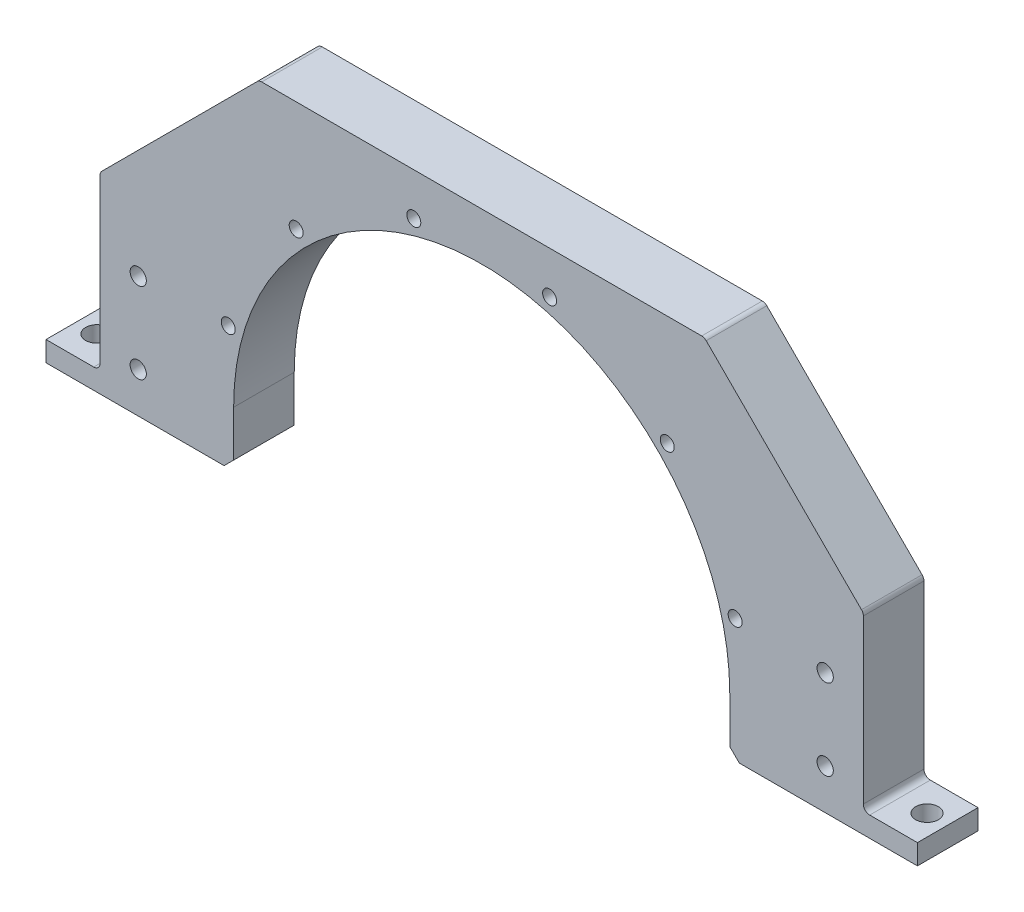
ISO-10303-21;
HEADER;
FILE_DESCRIPTION(('STEP AP214'),'2;1');
FILE_NAME('part.step','',(''),(''),'','','');
FILE_SCHEMA(('AUTOMOTIVE_DESIGN { 1 0 10303 214 1 1 1 1 }'));
ENDSEC;
DATA;
#1=APPLICATION_CONTEXT('core data for automotive mechanical design processes');
#2=APPLICATION_PROTOCOL_DEFINITION('international standard','automotive_design',2000,#1);
#3=PRODUCT_CONTEXT('',#1,'mechanical');
#4=PRODUCT('Part','Part','',(#3));
#5=PRODUCT_RELATED_PRODUCT_CATEGORY('part','',(#4));
#6=PRODUCT_DEFINITION_FORMATION('','',#4);
#7=PRODUCT_DEFINITION_CONTEXT('part definition',#1,'design');
#8=PRODUCT_DEFINITION('design','',#6,#7);
#9=PRODUCT_DEFINITION_SHAPE('','',#8);
#10=(LENGTH_UNIT() NAMED_UNIT(*) SI_UNIT(.MILLI.,.METRE.));
#11=(NAMED_UNIT(*) PLANE_ANGLE_UNIT() SI_UNIT($,.RADIAN.));
#12=(NAMED_UNIT(*) SI_UNIT($,.STERADIAN.) SOLID_ANGLE_UNIT());
#13=UNCERTAINTY_MEASURE_WITH_UNIT(LENGTH_MEASURE(1.E-05),#10,'distance_accuracy_value','');
#14=(GEOMETRIC_REPRESENTATION_CONTEXT(3) GLOBAL_UNCERTAINTY_ASSIGNED_CONTEXT((#13)) GLOBAL_UNIT_ASSIGNED_CONTEXT((#10,
#11,#12)) REPRESENTATION_CONTEXT('',''));
#15=CARTESIAN_POINT('',(0.,0.,0.));
#16=DIRECTION('',(0.,0.,1.));
#17=DIRECTION('',(1.,0.,0.));
#18=AXIS2_PLACEMENT_3D('',#15,#16,#17);
#19=CARTESIAN_POINT('',(0.,0.,19.05));
#20=DIRECTION('',(0.,0.,-1.));
#21=DIRECTION('',(-1.,0.,0.));
#22=AXIS2_PLACEMENT_3D('',#19,#20,#21);
#23=CYLINDRICAL_SURFACE('',#22,78.);
#24=CARTESIAN_POINT('',(0.,0.,0.));
#25=DIRECTION('',(0.,0.,-1.));
#26=DIRECTION('',(-1.,0.,0.));
#27=AXIS2_PLACEMENT_3D('',#24,#25,#26);
#28=CIRCLE('',#27,78.);
#29=CARTESIAN_POINT('',(-78.,0.,0.));
#30=VERTEX_POINT('',#29);
#31=CARTESIAN_POINT('',(78.,0.,0.));
#32=VERTEX_POINT('',#31);
#33=EDGE_CURVE('E304',#30,#32,#28,.T.);
#34=ORIENTED_EDGE('',*,*,#33,.T.);
#35=DIRECTION('',(0.,0.,-1.));
#36=VECTOR('',#35,1.);
#37=CARTESIAN_POINT('',(78.,0.,19.05));
#38=LINE('',#37,#36);
#39=CARTESIAN_POINT('',(78.,0.,19.05));
#40=VERTEX_POINT('',#39);
#41=EDGE_CURVE('E193',#40,#32,#38,.T.);
#42=ORIENTED_EDGE('',*,*,#41,.F.);
#43=CARTESIAN_POINT('',(0.,0.,19.05));
#44=DIRECTION('',(0.,0.,-1.));
#45=DIRECTION('',(-1.,0.,0.));
#46=AXIS2_PLACEMENT_3D('',#43,#44,#45);
#47=CIRCLE('',#46,78.);
#48=CARTESIAN_POINT('',(-78.,0.,19.05));
#49=VERTEX_POINT('',#48);
#50=EDGE_CURVE('E188',#49,#40,#47,.T.);
#51=ORIENTED_EDGE('',*,*,#50,.F.);
#52=DIRECTION('',(0.,0.,-1.));
#53=VECTOR('',#52,1.);
#54=CARTESIAN_POINT('',(-78.,0.,19.05));
#55=LINE('',#54,#53);
#56=EDGE_CURVE('E191',#49,#30,#55,.T.);
#57=ORIENTED_EDGE('',*,*,#56,.T.);
#58=EDGE_LOOP('',(#34,#42,#51,#57));
#59=FACE_BOUND('',#58,.T.);
#60=ADVANCED_FACE('F37',(#59),#23,.F.);
#61=CARTESIAN_POINT('',(78.,0.,19.05));
#62=DIRECTION('',(1.,0.,0.));
#63=DIRECTION('',(0.,0.,-1.));
#64=AXIS2_PLACEMENT_3D('',#61,#62,#63);
#65=PLANE('',#64);
#66=DIRECTION('',(0.,-1.,0.));
#67=VECTOR('',#66,1.);
#68=CARTESIAN_POINT('',(78.,0.,0.));
#69=LINE('',#68,#67);
#70=CARTESIAN_POINT('',(78.,-14.4,0.));
#71=VERTEX_POINT('',#70);
#72=EDGE_CURVE('E320',#32,#71,#69,.T.);
#73=ORIENTED_EDGE('',*,*,#72,.T.);
#74=DIRECTION('',(0.,0.,1.));
#75=VECTOR('',#74,1.);
#76=CARTESIAN_POINT('',(78.,-14.4,19.05));
#77=LINE('',#76,#75);
#78=CARTESIAN_POINT('',(78.,-14.4,19.05));
#79=VERTEX_POINT('',#78);
#80=EDGE_CURVE('E344',#71,#79,#77,.T.);
#81=ORIENTED_EDGE('',*,*,#80,.T.);
#82=DIRECTION('',(0.,-1.,0.));
#83=VECTOR('',#82,1.);
#84=CARTESIAN_POINT('',(78.,0.,19.05));
#85=LINE('',#84,#83);
#86=EDGE_CURVE('E197',#40,#79,#85,.T.);
#87=ORIENTED_EDGE('',*,*,#86,.F.);
#88=ORIENTED_EDGE('',*,*,#41,.T.);
#89=EDGE_LOOP('',(#73,#81,#87,#88));
#90=FACE_BOUND('',#89,.T.);
#91=ADVANCED_FACE('F512',(#90),#65,.F.);
#92=CARTESIAN_POINT('',(78.,-17.4,19.05));
#93=DIRECTION('',(0.,1.,0.));
#94=DIRECTION('',(0.,0.,1.));
#95=AXIS2_PLACEMENT_3D('',#92,#93,#94);
#96=PLANE('',#95);
#97=CARTESIAN_POINT('',(130.5,-17.4,9.525));
#98=DIRECTION('',(0.,1.,0.));
#99=DIRECTION('',(0.,0.,1.));
#100=AXIS2_PLACEMENT_3D('',#97,#98,#99);
#101=CIRCLE('',#100,3.57124);
#102=CARTESIAN_POINT('',(130.5,-17.4,13.09624));
#103=VERTEX_POINT('',#102);
#104=EDGE_CURVE('E272',#103,#103,#101,.T.);
#105=ORIENTED_EDGE('',*,*,#104,.T.);
#106=EDGE_LOOP('',(#105));
#107=FACE_BOUND('',#106,.T.);
#108=DIRECTION('',(1.,0.,0.));
#109=VECTOR('',#108,1.);
#110=CARTESIAN_POINT('',(78.,-17.4,19.05));
#111=LINE('',#110,#109);
#112=CARTESIAN_POINT('',(81.,-17.4,19.05));
#113=VERTEX_POINT('',#112);
#114=CARTESIAN_POINT('',(137.,-17.4,19.05));
#115=VERTEX_POINT('',#114);
#116=EDGE_CURVE('E307',#113,#115,#111,.T.);
#117=ORIENTED_EDGE('',*,*,#116,.F.);
#118=DIRECTION('',(0.,0.,-1.));
#119=VECTOR('',#118,1.);
#120=CARTESIAN_POINT('',(81.,-17.4,19.05));
#121=LINE('',#120,#119);
#122=CARTESIAN_POINT('',(81.,-17.4,0.));
#123=VERTEX_POINT('',#122);
#124=EDGE_CURVE('E339',#113,#123,#121,.T.);
#125=ORIENTED_EDGE('',*,*,#124,.T.);
#126=DIRECTION('',(1.,0.,0.));
#127=VECTOR('',#126,1.);
#128=CARTESIAN_POINT('',(78.,-17.4,0.));
#129=LINE('',#128,#127);
#130=CARTESIAN_POINT('',(137.,-17.4,0.));
#131=VERTEX_POINT('',#130);
#132=EDGE_CURVE('E323',#123,#131,#129,.T.);
#133=ORIENTED_EDGE('',*,*,#132,.T.);
#134=DIRECTION('',(0.,0.,-1.));
#135=VECTOR('',#134,1.);
#136=CARTESIAN_POINT('',(137.,-17.4,19.05));
#137=LINE('',#136,#135);
#138=EDGE_CURVE('E335',#115,#131,#137,.T.);
#139=ORIENTED_EDGE('',*,*,#138,.F.);
#140=EDGE_LOOP('',(#117,#125,#133,#139));
#141=FACE_BOUND('',#140,.T.);
#142=ADVANCED_FACE('F517',(#107,#141),#96,.F.);
#143=CARTESIAN_POINT('',(137.,-17.4,19.05));
#144=DIRECTION('',(-1.,0.,0.));
#145=DIRECTION('',(0.,0.,1.));
#146=AXIS2_PLACEMENT_3D('',#143,#144,#145);
#147=PLANE('',#146);
#148=DIRECTION('',(0.,1.,0.));
#149=VECTOR('',#148,1.);
#150=CARTESIAN_POINT('',(137.,-17.4,0.));
#151=LINE('',#150,#149);
#152=CARTESIAN_POINT('',(137.,-11.05,0.));
#153=VERTEX_POINT('',#152);
#154=EDGE_CURVE('E325',#131,#153,#151,.T.);
#155=ORIENTED_EDGE('',*,*,#154,.T.);
#156=DIRECTION('',(0.,0.,-1.));
#157=VECTOR('',#156,1.);
#158=CARTESIAN_POINT('',(137.,-11.05,19.05));
#159=LINE('',#158,#157);
#160=CARTESIAN_POINT('',(137.,-11.05,19.05));
#161=VERTEX_POINT('',#160);
#162=EDGE_CURVE('E318',#161,#153,#159,.T.);
#163=ORIENTED_EDGE('',*,*,#162,.F.);
#164=DIRECTION('',(0.,1.,0.));
#165=VECTOR('',#164,1.);
#166=CARTESIAN_POINT('',(137.,-17.4,19.05));
#167=LINE('',#166,#165);
#168=EDGE_CURVE('E309',#115,#161,#167,.T.);
#169=ORIENTED_EDGE('',*,*,#168,.F.);
#170=ORIENTED_EDGE('',*,*,#138,.T.);
#171=EDGE_LOOP('',(#155,#163,#169,#170));
#172=FACE_BOUND('',#171,.T.);
#173=ADVANCED_FACE('F717',(#172),#147,.F.);
#174=CARTESIAN_POINT('',(137.,-11.05,19.05));
#175=DIRECTION('',(0.,-1.,0.));
#176=DIRECTION('',(0.,0.,-1.));
#177=AXIS2_PLACEMENT_3D('',#174,#175,#176);
#178=PLANE('',#177);
#179=CARTESIAN_POINT('',(130.5,-11.05,9.525));
#180=DIRECTION('',(0.,1.,0.));
#181=DIRECTION('',(0.,0.,1.));
#182=AXIS2_PLACEMENT_3D('',#179,#180,#181);
#183=CIRCLE('',#182,3.57124);
#184=CARTESIAN_POINT('',(130.5,-11.05,13.09624));
#185=VERTEX_POINT('',#184);
#186=EDGE_CURVE('E269',#185,#185,#183,.T.);
#187=ORIENTED_EDGE('',*,*,#186,.F.);
#188=EDGE_LOOP('',(#187));
#189=FACE_BOUND('',#188,.T.);
#190=DIRECTION('',(-1.,0.,0.));
#191=VECTOR('',#190,1.);
#192=CARTESIAN_POINT('',(137.,-11.05,0.));
#193=LINE('',#192,#191);
#194=CARTESIAN_POINT('',(122.,-11.05,0.));
#195=VERTEX_POINT('',#194);
#196=EDGE_CURVE('E327',#153,#195,#193,.T.);
#197=ORIENTED_EDGE('',*,*,#196,.T.);
#198=DIRECTION('',(0.,0.,-1.));
#199=VECTOR('',#198,1.);
#200=CARTESIAN_POINT('',(122.,-11.05,19.05));
#201=LINE('',#200,#199);
#202=CARTESIAN_POINT('',(122.,-11.05,19.05));
#203=VERTEX_POINT('',#202);
#204=EDGE_CURVE('E52',#195,#203,#201,.F.);
#205=ORIENTED_EDGE('',*,*,#204,.T.);
#206=DIRECTION('',(-1.,0.,0.));
#207=VECTOR('',#206,1.);
#208=CARTESIAN_POINT('',(137.,-11.05,19.05));
#209=LINE('',#208,#207);
#210=EDGE_CURVE('E311',#161,#203,#209,.T.);
#211=ORIENTED_EDGE('',*,*,#210,.F.);
#212=ORIENTED_EDGE('',*,*,#162,.T.);
#213=EDGE_LOOP('',(#197,#205,#211,#212));
#214=FACE_BOUND('',#213,.T.);
#215=ADVANCED_FACE('F381',(#189,#214),#178,.F.);
#216=CARTESIAN_POINT('',(120.,-11.05,19.05));
#217=DIRECTION('',(-1.,0.,0.));
#218=DIRECTION('',(0.,0.,1.));
#219=AXIS2_PLACEMENT_3D('',#216,#217,#218);
#220=PLANE('',#219);
#221=DIRECTION('',(0.,1.,0.));
#222=VECTOR('',#221,1.);
#223=CARTESIAN_POINT('',(120.,-11.05,0.));
#224=LINE('',#223,#222);
#225=CARTESIAN_POINT('',(120.,-9.04999999999999,0.));
#226=VERTEX_POINT('',#225);
#227=CARTESIAN_POINT('',(120.,42.1715728752537,0.));
#228=VERTEX_POINT('',#227);
#229=EDGE_CURVE('E329',#226,#228,#224,.T.);
#230=ORIENTED_EDGE('',*,*,#229,.T.);
#231=DIRECTION('',(0.,0.,-1.));
#232=VECTOR('',#231,1.);
#233=CARTESIAN_POINT('',(120.,42.1715728752537,19.05));
#234=LINE('',#233,#232);
#235=CARTESIAN_POINT('',(120.,42.1715728752537,19.05));
#236=VERTEX_POINT('',#235);
#237=EDGE_CURVE('E370',#228,#236,#234,.F.);
#238=ORIENTED_EDGE('',*,*,#237,.T.);
#239=DIRECTION('',(0.,1.,0.));
#240=VECTOR('',#239,1.);
#241=CARTESIAN_POINT('',(120.,-11.05,19.05));
#242=LINE('',#241,#240);
#243=CARTESIAN_POINT('',(120.,-9.04999999999999,19.05));
#244=VERTEX_POINT('',#243);
#245=EDGE_CURVE('E313',#244,#236,#242,.T.);
#246=ORIENTED_EDGE('',*,*,#245,.F.);
#247=DIRECTION('',(0.,0.,-1.));
#248=VECTOR('',#247,1.);
#249=CARTESIAN_POINT('',(120.,-9.04999999999999,0.));
#250=LINE('',#249,#248);
#251=EDGE_CURVE('E367',#244,#226,#250,.T.);
#252=ORIENTED_EDGE('',*,*,#251,.T.);
#253=EDGE_LOOP('',(#230,#238,#246,#252));
#254=FACE_BOUND('',#253,.T.);
#255=ADVANCED_FACE('F386',(#254),#220,.F.);
#256=CARTESIAN_POINT('',(120.,93.,19.05));
#257=DIRECTION('',(0.,-1.,0.));
#258=DIRECTION('',(1.,0.,0.));
#259=AXIS2_PLACEMENT_3D('',#256,#257,#258);
#260=PLANE('',#259);
#261=DIRECTION('',(-1.,0.,0.));
#262=VECTOR('',#261,1.);
#263=CARTESIAN_POINT('',(120.,93.,19.05));
#264=LINE('',#263,#262);
#265=CARTESIAN_POINT('',(69.1715728752538,93.,19.05));
#266=VERTEX_POINT('',#265);
#267=CARTESIAN_POINT('',(-69.1715728752538,93.,19.05));
#268=VERTEX_POINT('',#267);
#269=EDGE_CURVE('E316',#266,#268,#264,.T.);
#270=ORIENTED_EDGE('',*,*,#269,.F.);
#271=DIRECTION('',(0.,0.,1.));
#272=VECTOR('',#271,1.);
#273=CARTESIAN_POINT('',(69.1715728752538,93.,0.));
#274=LINE('',#273,#272);
#275=CARTESIAN_POINT('',(69.1715728752538,93.,0.));
#276=VERTEX_POINT('',#275);
#277=EDGE_CURVE('E353',#266,#276,#274,.F.);
#278=ORIENTED_EDGE('',*,*,#277,.T.);
#279=DIRECTION('',(-1.,0.,0.));
#280=VECTOR('',#279,1.);
#281=CARTESIAN_POINT('',(120.,93.,0.));
#282=LINE('',#281,#280);
#283=CARTESIAN_POINT('',(-69.1715728752538,93.,0.));
#284=VERTEX_POINT('',#283);
#285=EDGE_CURVE('E198',#276,#284,#282,.T.);
#286=ORIENTED_EDGE('',*,*,#285,.T.);
#287=DIRECTION('',(0.,0.,1.));
#288=VECTOR('',#287,1.);
#289=CARTESIAN_POINT('',(-69.1715728752538,93.,0.));
#290=LINE('',#289,#288);
#291=EDGE_CURVE('E238',#268,#284,#290,.F.);
#292=ORIENTED_EDGE('',*,*,#291,.F.);
#293=EDGE_LOOP('',(#270,#278,#286,#292));
#294=FACE_BOUND('',#293,.T.);
#295=ADVANCED_FACE('F402',(#294),#260,.F.);
#296=CARTESIAN_POINT('',(0.,0.,19.05));
#297=DIRECTION('',(0.,0.,-1.));
#298=DIRECTION('',(-1.,0.,0.));
#299=AXIS2_PLACEMENT_3D('',#296,#297,#298);
#300=PLANE('',#299);
#301=CARTESIAN_POINT('',(108.,20.7,19.05));
#302=DIRECTION('',(0.,0.,1.));
#303=DIRECTION('',(1.,0.,0.));
#304=AXIS2_PLACEMENT_3D('',#301,#302,#303);
#305=CIRCLE('',#304,2.55269999999999);
#306=CARTESIAN_POINT('',(110.5527,20.7,19.05));
#307=VERTEX_POINT('',#306);
#308=EDGE_CURVE('E275',#307,#307,#305,.T.);
#309=ORIENTED_EDGE('',*,*,#308,.F.);
#310=EDGE_LOOP('',(#309));
#311=FACE_BOUND('',#310,.T.);
#312=CARTESIAN_POINT('',(108.,-4.69999999999999,19.05));
#313=DIRECTION('',(0.,0.,1.));
#314=DIRECTION('',(1.,0.,0.));
#315=AXIS2_PLACEMENT_3D('',#312,#313,#314);
#316=CIRCLE('',#315,2.55269999999999);
#317=CARTESIAN_POINT('',(110.5527,-4.69999999999999,19.05));
#318=VERTEX_POINT('',#317);
#319=EDGE_CURVE('E281',#318,#318,#316,.T.);
#320=ORIENTED_EDGE('',*,*,#319,.F.);
#321=EDGE_LOOP('',(#320));
#322=FACE_BOUND('',#321,.T.);
#323=CARTESIAN_POINT('',(21.352571220958,79.6888806688481,19.05));
#324=DIRECTION('',(0.,0.,1.));
#325=DIRECTION('',(1.,0.,0.));
#326=AXIS2_PLACEMENT_3D('',#323,#324,#325);
#327=CIRCLE('',#326,2.19709999999999);
#328=CARTESIAN_POINT('',(23.549671220958,79.6888806688481,19.05));
#329=VERTEX_POINT('',#328);
#330=EDGE_CURVE('E287',#329,#329,#327,.T.);
#331=ORIENTED_EDGE('',*,*,#330,.F.);
#332=EDGE_LOOP('',(#331));
#333=FACE_BOUND('',#332,.T.);
#334=CARTESIAN_POINT('',(58.3363094478902,58.3363094478902,19.05));
#335=DIRECTION('',(0.,0.,1.));
#336=DIRECTION('',(1.,0.,0.));
#337=AXIS2_PLACEMENT_3D('',#334,#335,#336);
#338=CIRCLE('',#337,2.19709999999999);
#339=CARTESIAN_POINT('',(60.5334094478902,58.3363094478902,19.05));
#340=VERTEX_POINT('',#339);
#341=EDGE_CURVE('E293',#340,#340,#338,.T.);
#342=ORIENTED_EDGE('',*,*,#341,.F.);
#343=EDGE_LOOP('',(#342));
#344=FACE_BOUND('',#343,.T.);
#345=CARTESIAN_POINT('',(79.6888806688481,21.352571220958,19.05));
#346=DIRECTION('',(0.,0.,1.));
#347=DIRECTION('',(1.,0.,0.));
#348=AXIS2_PLACEMENT_3D('',#345,#346,#347);
#349=CIRCLE('',#348,2.19709999999999);
#350=CARTESIAN_POINT('',(81.8859806688481,21.352571220958,19.05));
#351=VERTEX_POINT('',#350);
#352=EDGE_CURVE('E299',#351,#351,#349,.T.);
#353=ORIENTED_EDGE('',*,*,#352,.F.);
#354=EDGE_LOOP('',(#353));
#355=FACE_BOUND('',#354,.T.);
#356=DIRECTION('',(0.707106781186546,-0.707106781186549,0.));
#357=VECTOR('',#356,1.);
#358=CARTESIAN_POINT('',(70.,93.,19.05));
#359=LINE('',#358,#357);
#360=CARTESIAN_POINT('',(119.414213562373,43.5857864376268,19.05));
#361=VERTEX_POINT('',#360);
#362=CARTESIAN_POINT('',(70.5857864376269,92.4142135623731,19.05));
#363=VERTEX_POINT('',#362);
#364=EDGE_CURVE('E351',#361,#363,#359,.F.);
#365=ORIENTED_EDGE('',*,*,#364,.T.);
#366=CARTESIAN_POINT('',(69.1715728752538,91.,19.05));
#367=DIRECTION('',(0.,0.,-1.));
#368=DIRECTION('',(-1.,0.,0.));
#369=AXIS2_PLACEMENT_3D('',#366,#367,#368);
#370=CIRCLE('',#369,2.);
#371=EDGE_CURVE('E365',#363,#266,#370,.F.);
#372=ORIENTED_EDGE('',*,*,#371,.T.);
#373=ORIENTED_EDGE('',*,*,#269,.T.);
#374=CARTESIAN_POINT('',(-69.1715728752538,91.,19.05));
#375=DIRECTION('',(0.,0.,1.));
#376=DIRECTION('',(1.,0.,0.));
#377=AXIS2_PLACEMENT_3D('',#374,#375,#376);
#378=CIRCLE('',#377,2.);
#379=CARTESIAN_POINT('',(-70.5857864376269,92.4142135623731,19.05));
#380=VERTEX_POINT('',#379);
#381=EDGE_CURVE('E253',#380,#268,#378,.F.);
#382=ORIENTED_EDGE('',*,*,#381,.F.);
#383=DIRECTION('',(-0.707106781186546,-0.707106781186549,0.));
#384=VECTOR('',#383,1.);
#385=CARTESIAN_POINT('',(-70.,93.,19.05));
#386=LINE('',#385,#384);
#387=CARTESIAN_POINT('',(-119.414213562373,43.5857864376268,19.05));
#388=VERTEX_POINT('',#387);
#389=EDGE_CURVE('E235',#388,#380,#386,.F.);
#390=ORIENTED_EDGE('',*,*,#389,.F.);
#391=CARTESIAN_POINT('',(-118.,42.1715728752537,19.05));
#392=DIRECTION('',(0.,0.,1.));
#393=DIRECTION('',(1.,0.,0.));
#394=AXIS2_PLACEMENT_3D('',#391,#392,#393);
#395=CIRCLE('',#394,2.);
#396=CARTESIAN_POINT('',(-120.,42.1715728752537,19.05));
#397=VERTEX_POINT('',#396);
#398=EDGE_CURVE('E250',#397,#388,#395,.F.);
#399=ORIENTED_EDGE('',*,*,#398,.F.);
#400=DIRECTION('',(0.,1.,0.));
#401=VECTOR('',#400,1.);
#402=CARTESIAN_POINT('',(-120.,-11.05,19.05));
#403=LINE('',#402,#401);
#404=CARTESIAN_POINT('',(-120.,-9.04999999999999,19.05));
#405=VERTEX_POINT('',#404);
#406=EDGE_CURVE('E416',#405,#397,#403,.T.);
#407=ORIENTED_EDGE('',*,*,#406,.F.);
#408=CARTESIAN_POINT('',(-122.,-9.04999999999999,19.05));
#409=DIRECTION('',(0.,0.,1.));
#410=DIRECTION('',(1.,0.,0.));
#411=AXIS2_PLACEMENT_3D('',#408,#409,#410);
#412=CIRCLE('',#411,2.);
#413=CARTESIAN_POINT('',(-122.,-11.05,19.05));
#414=VERTEX_POINT('',#413);
#415=EDGE_CURVE('E267',#414,#405,#412,.T.);
#416=ORIENTED_EDGE('',*,*,#415,.F.);
#417=DIRECTION('',(1.,0.,0.));
#418=VECTOR('',#417,1.);
#419=CARTESIAN_POINT('',(-137.,-11.05,19.05));
#420=LINE('',#419,#418);
#421=CARTESIAN_POINT('',(-137.,-11.05,19.05));
#422=VERTEX_POINT('',#421);
#423=EDGE_CURVE('E419',#422,#414,#420,.T.);
#424=ORIENTED_EDGE('',*,*,#423,.F.);
#425=DIRECTION('',(0.,1.,0.));
#426=VECTOR('',#425,1.);
#427=CARTESIAN_POINT('',(-137.,-17.4,19.05));
#428=LINE('',#427,#426);
#429=CARTESIAN_POINT('',(-137.,-17.4,19.05));
#430=VERTEX_POINT('',#429);
#431=EDGE_CURVE('E434',#430,#422,#428,.T.);
#432=ORIENTED_EDGE('',*,*,#431,.F.);
#433=DIRECTION('',(-1.,0.,0.));
#434=VECTOR('',#433,1.);
#435=CARTESIAN_POINT('',(-78.,-17.4,19.05));
#436=LINE('',#435,#434);
#437=CARTESIAN_POINT('',(-81.,-17.4,19.05));
#438=VERTEX_POINT('',#437);
#439=EDGE_CURVE('E210',#438,#430,#436,.T.);
#440=ORIENTED_EDGE('',*,*,#439,.F.);
#441=DIRECTION('',(0.707106781186548,0.707106781186548,0.));
#442=VECTOR('',#441,1.);
#443=CARTESIAN_POINT('',(-81.,-17.4,19.05));
#444=LINE('',#443,#442);
#445=CARTESIAN_POINT('',(-78.,-14.4,19.05));
#446=VERTEX_POINT('',#445);
#447=EDGE_CURVE('E206',#446,#438,#444,.F.);
#448=ORIENTED_EDGE('',*,*,#447,.F.);
#449=DIRECTION('',(0.,-1.,0.));
#450=VECTOR('',#449,1.);
#451=CARTESIAN_POINT('',(-78.,0.,19.05));
#452=LINE('',#451,#450);
#453=EDGE_CURVE('E201',#49,#446,#452,.T.);
#454=ORIENTED_EDGE('',*,*,#453,.F.);
#455=ORIENTED_EDGE('',*,*,#50,.T.);
#456=ORIENTED_EDGE('',*,*,#86,.T.);
#457=DIRECTION('',(-0.707106781186548,0.707106781186548,0.));
#458=VECTOR('',#457,1.);
#459=CARTESIAN_POINT('',(81.,-17.4,19.05));
#460=LINE('',#459,#458);
#461=EDGE_CURVE('E346',#79,#113,#460,.F.);
#462=ORIENTED_EDGE('',*,*,#461,.T.);
#463=ORIENTED_EDGE('',*,*,#116,.T.);
#464=ORIENTED_EDGE('',*,*,#168,.T.);
#465=ORIENTED_EDGE('',*,*,#210,.T.);
#466=CARTESIAN_POINT('',(122.,-9.04999999999999,19.05));
#467=DIRECTION('',(0.,0.,-1.));
#468=DIRECTION('',(-1.,0.,0.));
#469=AXIS2_PLACEMENT_3D('',#466,#467,#468);
#470=CIRCLE('',#469,2.);
#471=EDGE_CURVE('E11',#203,#244,#470,.T.);
#472=ORIENTED_EDGE('',*,*,#471,.T.);
#473=ORIENTED_EDGE('',*,*,#245,.T.);
#474=CARTESIAN_POINT('',(118.,42.1715728752537,19.05));
#475=DIRECTION('',(0.,0.,-1.));
#476=DIRECTION('',(-1.,0.,0.));
#477=AXIS2_PLACEMENT_3D('',#474,#475,#476);
#478=CIRCLE('',#477,2.);
#479=EDGE_CURVE('E60',#236,#361,#478,.F.);
#480=ORIENTED_EDGE('',*,*,#479,.T.);
#481=EDGE_LOOP('',(#365,#372,#373,#382,#390,#399,#407,#416,#424,#432,#440,#448,#454,#455,#456,
#462,#463,#464,#465,#472,#473,#480));
#482=FACE_BOUND('',#481,.T.);
#483=CARTESIAN_POINT('',(-108.,20.7,19.05));
#484=DIRECTION('',(0.,0.,-1.));
#485=DIRECTION('',(-1.,0.,0.));
#486=AXIS2_PLACEMENT_3D('',#483,#484,#485);
#487=CIRCLE('',#486,2.55269999999999);
#488=CARTESIAN_POINT('',(-110.5527,20.7,19.05));
#489=VERTEX_POINT('',#488);
#490=EDGE_CURVE('E484',#489,#489,#487,.T.);
#491=ORIENTED_EDGE('',*,*,#490,.T.);
#492=EDGE_LOOP('',(#491));
#493=FACE_BOUND('',#492,.T.);
#494=CARTESIAN_POINT('',(-108.,-4.69999999999999,19.05));
#495=DIRECTION('',(0.,0.,-1.));
#496=DIRECTION('',(-1.,0.,0.));
#497=AXIS2_PLACEMENT_3D('',#494,#495,#496);
#498=CIRCLE('',#497,2.55269999999999);
#499=CARTESIAN_POINT('',(-110.5527,-4.69999999999999,19.05));
#500=VERTEX_POINT('',#499);
#501=EDGE_CURVE('E478',#500,#500,#498,.T.);
#502=ORIENTED_EDGE('',*,*,#501,.T.);
#503=EDGE_LOOP('',(#502));
#504=FACE_BOUND('',#503,.T.);
#505=CARTESIAN_POINT('',(-21.352571220958,79.6888806688481,19.05));
#506=DIRECTION('',(0.,0.,-1.));
#507=DIRECTION('',(-1.,0.,0.));
#508=AXIS2_PLACEMENT_3D('',#505,#506,#507);
#509=CIRCLE('',#508,2.19709999999999);
#510=CARTESIAN_POINT('',(-23.549671220958,79.6888806688481,19.05));
#511=VERTEX_POINT('',#510);
#512=EDGE_CURVE('E472',#511,#511,#509,.T.);
#513=ORIENTED_EDGE('',*,*,#512,.T.);
#514=EDGE_LOOP('',(#513));
#515=FACE_BOUND('',#514,.T.);
#516=CARTESIAN_POINT('',(-58.3363094478902,58.3363094478902,19.05));
#517=DIRECTION('',(0.,0.,-1.));
#518=DIRECTION('',(-1.,0.,0.));
#519=AXIS2_PLACEMENT_3D('',#516,#517,#518);
#520=CIRCLE('',#519,2.19709999999999);
#521=CARTESIAN_POINT('',(-60.5334094478902,58.3363094478902,19.05));
#522=VERTEX_POINT('',#521);
#523=EDGE_CURVE('E466',#522,#522,#520,.T.);
#524=ORIENTED_EDGE('',*,*,#523,.T.);
#525=EDGE_LOOP('',(#524));
#526=FACE_BOUND('',#525,.T.);
#527=CARTESIAN_POINT('',(-79.6888806688481,21.352571220958,19.05));
#528=DIRECTION('',(0.,0.,-1.));
#529=DIRECTION('',(-1.,0.,0.));
#530=AXIS2_PLACEMENT_3D('',#527,#528,#529);
#531=CIRCLE('',#530,2.19709999999999);
#532=CARTESIAN_POINT('',(-81.8859806688481,21.352571220958,19.05));
#533=VERTEX_POINT('',#532);
#534=EDGE_CURVE('E460',#533,#533,#531,.T.);
#535=ORIENTED_EDGE('',*,*,#534,.T.);
#536=EDGE_LOOP('',(#535));
#537=FACE_BOUND('',#536,.T.);
#538=ADVANCED_FACE('F203',(#311,#322,#333,#344,#355,#482,#493,#504,#515,#526,#537),#300,.F.);
#539=CARTESIAN_POINT('',(0.,0.,0.));
#540=DIRECTION('',(0.,0.,-1.));
#541=DIRECTION('',(-1.,0.,0.));
#542=AXIS2_PLACEMENT_3D('',#539,#540,#541);
#543=PLANE('',#542);
#544=CARTESIAN_POINT('',(108.,20.7,0.));
#545=DIRECTION('',(0.,0.,1.));
#546=DIRECTION('',(1.,0.,0.));
#547=AXIS2_PLACEMENT_3D('',#544,#545,#546);
#548=CIRCLE('',#547,2.55269999999999);
#549=CARTESIAN_POINT('',(110.5527,20.7,0.));
#550=VERTEX_POINT('',#549);
#551=EDGE_CURVE('E278',#550,#550,#548,.T.);
#552=ORIENTED_EDGE('',*,*,#551,.T.);
#553=EDGE_LOOP('',(#552));
#554=FACE_BOUND('',#553,.T.);
#555=CARTESIAN_POINT('',(108.,-4.69999999999999,0.));
#556=DIRECTION('',(0.,0.,1.));
#557=DIRECTION('',(1.,0.,0.));
#558=AXIS2_PLACEMENT_3D('',#555,#556,#557);
#559=CIRCLE('',#558,2.55269999999999);
#560=CARTESIAN_POINT('',(110.5527,-4.69999999999999,0.));
#561=VERTEX_POINT('',#560);
#562=EDGE_CURVE('E284',#561,#561,#559,.T.);
#563=ORIENTED_EDGE('',*,*,#562,.T.);
#564=EDGE_LOOP('',(#563));
#565=FACE_BOUND('',#564,.T.);
#566=CARTESIAN_POINT('',(21.352571220958,79.6888806688481,0.));
#567=DIRECTION('',(0.,0.,1.));
#568=DIRECTION('',(1.,0.,0.));
#569=AXIS2_PLACEMENT_3D('',#566,#567,#568);
#570=CIRCLE('',#569,2.19709999999999);
#571=CARTESIAN_POINT('',(23.549671220958,79.6888806688481,0.));
#572=VERTEX_POINT('',#571);
#573=EDGE_CURVE('E290',#572,#572,#570,.T.);
#574=ORIENTED_EDGE('',*,*,#573,.T.);
#575=EDGE_LOOP('',(#574));
#576=FACE_BOUND('',#575,.T.);
#577=CARTESIAN_POINT('',(58.3363094478902,58.3363094478902,0.));
#578=DIRECTION('',(0.,0.,1.));
#579=DIRECTION('',(1.,0.,0.));
#580=AXIS2_PLACEMENT_3D('',#577,#578,#579);
#581=CIRCLE('',#580,2.19709999999999);
#582=CARTESIAN_POINT('',(60.5334094478902,58.3363094478902,0.));
#583=VERTEX_POINT('',#582);
#584=EDGE_CURVE('E296',#583,#583,#581,.T.);
#585=ORIENTED_EDGE('',*,*,#584,.T.);
#586=EDGE_LOOP('',(#585));
#587=FACE_BOUND('',#586,.T.);
#588=CARTESIAN_POINT('',(79.6888806688481,21.352571220958,0.));
#589=DIRECTION('',(0.,0.,1.));
#590=DIRECTION('',(1.,0.,0.));
#591=AXIS2_PLACEMENT_3D('',#588,#589,#590);
#592=CIRCLE('',#591,2.19709999999999);
#593=CARTESIAN_POINT('',(81.8859806688481,21.352571220958,0.));
#594=VERTEX_POINT('',#593);
#595=EDGE_CURVE('E302',#594,#594,#592,.T.);
#596=ORIENTED_EDGE('',*,*,#595,.T.);
#597=EDGE_LOOP('',(#596));
#598=FACE_BOUND('',#597,.T.);
#599=ORIENTED_EDGE('',*,*,#285,.F.);
#600=CARTESIAN_POINT('',(69.1715728752538,91.,0.));
#601=DIRECTION('',(0.,0.,-1.));
#602=DIRECTION('',(-1.,0.,0.));
#603=AXIS2_PLACEMENT_3D('',#600,#601,#602);
#604=CIRCLE('',#603,2.);
#605=CARTESIAN_POINT('',(70.5857864376269,92.4142135623731,0.));
#606=VERTEX_POINT('',#605);
#607=EDGE_CURVE('E358',#276,#606,#604,.T.);
#608=ORIENTED_EDGE('',*,*,#607,.T.);
#609=DIRECTION('',(-0.707106781186546,0.707106781186549,0.));
#610=VECTOR('',#609,1.);
#611=CARTESIAN_POINT('',(81.5000000000001,81.4999999999998,0.));
#612=LINE('',#611,#610);
#613=CARTESIAN_POINT('',(119.414213562373,43.5857864376268,0.));
#614=VERTEX_POINT('',#613);
#615=EDGE_CURVE('E348',#606,#614,#612,.F.);
#616=ORIENTED_EDGE('',*,*,#615,.T.);
#617=CARTESIAN_POINT('',(118.,42.1715728752537,0.));
#618=DIRECTION('',(0.,0.,-1.));
#619=DIRECTION('',(-1.,0.,0.));
#620=AXIS2_PLACEMENT_3D('',#617,#618,#619);
#621=CIRCLE('',#620,2.);
#622=EDGE_CURVE('E356',#614,#228,#621,.T.);
#623=ORIENTED_EDGE('',*,*,#622,.T.);
#624=ORIENTED_EDGE('',*,*,#229,.F.);
#625=CARTESIAN_POINT('',(122.,-9.04999999999999,0.));
#626=DIRECTION('',(0.,0.,-1.));
#627=DIRECTION('',(-1.,0.,0.));
#628=AXIS2_PLACEMENT_3D('',#625,#626,#627);
#629=CIRCLE('',#628,2.);
#630=EDGE_CURVE('E45',#226,#195,#629,.F.);
#631=ORIENTED_EDGE('',*,*,#630,.T.);
#632=ORIENTED_EDGE('',*,*,#196,.F.);
#633=ORIENTED_EDGE('',*,*,#154,.F.);
#634=ORIENTED_EDGE('',*,*,#132,.F.);
#635=DIRECTION('',(0.707106781186548,-0.707106781186548,0.));
#636=VECTOR('',#635,1.);
#637=CARTESIAN_POINT('',(31.8,31.8,0.));
#638=LINE('',#637,#636);
#639=EDGE_CURVE('E342',#123,#71,#638,.F.);
#640=ORIENTED_EDGE('',*,*,#639,.T.);
#641=ORIENTED_EDGE('',*,*,#72,.F.);
#642=ORIENTED_EDGE('',*,*,#33,.F.);
#643=DIRECTION('',(0.,-1.,0.));
#644=VECTOR('',#643,1.);
#645=CARTESIAN_POINT('',(-78.,0.,0.));
#646=LINE('',#645,#644);
#647=CARTESIAN_POINT('',(-78.,-14.4,0.));
#648=VERTEX_POINT('',#647);
#649=EDGE_CURVE('E216',#30,#648,#646,.T.);
#650=ORIENTED_EDGE('',*,*,#649,.T.);
#651=DIRECTION('',(-0.707106781186548,-0.707106781186548,0.));
#652=VECTOR('',#651,1.);
#653=CARTESIAN_POINT('',(-31.8,31.8,0.));
#654=LINE('',#653,#652);
#655=CARTESIAN_POINT('',(-81.,-17.4,0.));
#656=VERTEX_POINT('',#655);
#657=EDGE_CURVE('E221',#656,#648,#654,.F.);
#658=ORIENTED_EDGE('',*,*,#657,.F.);
#659=DIRECTION('',(-1.,0.,0.));
#660=VECTOR('',#659,1.);
#661=CARTESIAN_POINT('',(-78.,-17.4,0.));
#662=LINE('',#661,#660);
#663=CARTESIAN_POINT('',(-137.,-17.4,0.));
#664=VERTEX_POINT('',#663);
#665=EDGE_CURVE('E440',#656,#664,#662,.T.);
#666=ORIENTED_EDGE('',*,*,#665,.T.);
#667=DIRECTION('',(0.,1.,0.));
#668=VECTOR('',#667,1.);
#669=CARTESIAN_POINT('',(-137.,-17.4,0.));
#670=LINE('',#669,#668);
#671=CARTESIAN_POINT('',(-137.,-11.05,0.));
#672=VERTEX_POINT('',#671);
#673=EDGE_CURVE('E444',#664,#672,#670,.T.);
#674=ORIENTED_EDGE('',*,*,#673,.T.);
#675=DIRECTION('',(1.,0.,0.));
#676=VECTOR('',#675,1.);
#677=CARTESIAN_POINT('',(-137.,-11.05,0.));
#678=LINE('',#677,#676);
#679=CARTESIAN_POINT('',(-122.,-11.05,0.));
#680=VERTEX_POINT('',#679);
#681=EDGE_CURVE('E447',#672,#680,#678,.T.);
#682=ORIENTED_EDGE('',*,*,#681,.T.);
#683=CARTESIAN_POINT('',(-122.,-9.04999999999999,0.));
#684=DIRECTION('',(0.,0.,1.));
#685=DIRECTION('',(1.,0.,0.));
#686=AXIS2_PLACEMENT_3D('',#683,#684,#685);
#687=CIRCLE('',#686,2.);
#688=CARTESIAN_POINT('',(-120.,-9.04999999999999,0.));
#689=VERTEX_POINT('',#688);
#690=EDGE_CURVE('E265',#689,#680,#687,.F.);
#691=ORIENTED_EDGE('',*,*,#690,.F.);
#692=DIRECTION('',(0.,1.,0.));
#693=VECTOR('',#692,1.);
#694=CARTESIAN_POINT('',(-120.,-11.05,0.));
#695=LINE('',#694,#693);
#696=CARTESIAN_POINT('',(-120.,42.1715728752537,0.));
#697=VERTEX_POINT('',#696);
#698=EDGE_CURVE('E211',#689,#697,#695,.T.);
#699=ORIENTED_EDGE('',*,*,#698,.T.);
#700=CARTESIAN_POINT('',(-118.,42.1715728752537,0.));
#701=DIRECTION('',(0.,0.,1.));
#702=DIRECTION('',(1.,0.,0.));
#703=AXIS2_PLACEMENT_3D('',#700,#701,#702);
#704=CIRCLE('',#703,2.);
#705=CARTESIAN_POINT('',(-119.414213562373,43.5857864376268,0.));
#706=VERTEX_POINT('',#705);
#707=EDGE_CURVE('E241',#706,#697,#704,.T.);
#708=ORIENTED_EDGE('',*,*,#707,.F.);
#709=DIRECTION('',(0.707106781186546,0.707106781186549,0.));
#710=VECTOR('',#709,1.);
#711=CARTESIAN_POINT('',(-81.5000000000001,81.4999999999998,0.));
#712=LINE('',#711,#710);
#713=CARTESIAN_POINT('',(-70.5857864376269,92.4142135623731,0.));
#714=VERTEX_POINT('',#713);
#715=EDGE_CURVE('E232',#714,#706,#712,.F.);
#716=ORIENTED_EDGE('',*,*,#715,.F.);
#717=CARTESIAN_POINT('',(-69.1715728752538,91.,0.));
#718=DIRECTION('',(0.,0.,1.));
#719=DIRECTION('',(1.,0.,0.));
#720=AXIS2_PLACEMENT_3D('',#717,#718,#719);
#721=CIRCLE('',#720,2.);
#722=EDGE_CURVE('E243',#284,#714,#721,.T.);
#723=ORIENTED_EDGE('',*,*,#722,.F.);
#724=EDGE_LOOP('',(#599,#608,#616,#623,#624,#631,#632,#633,#634,#640,#641,#642,#650,#658,#666,
#674,#682,#691,#699,#708,#716,#723));
#725=FACE_BOUND('',#724,.T.);
#726=CARTESIAN_POINT('',(-108.,20.7,0.));
#727=DIRECTION('',(0.,0.,-1.));
#728=DIRECTION('',(-1.,0.,0.));
#729=AXIS2_PLACEMENT_3D('',#726,#727,#728);
#730=CIRCLE('',#729,2.55269999999999);
#731=CARTESIAN_POINT('',(-110.5527,20.7,0.));
#732=VERTEX_POINT('',#731);
#733=EDGE_CURVE('E481',#732,#732,#730,.T.);
#734=ORIENTED_EDGE('',*,*,#733,.F.);
#735=EDGE_LOOP('',(#734));
#736=FACE_BOUND('',#735,.T.);
#737=CARTESIAN_POINT('',(-108.,-4.69999999999999,0.));
#738=DIRECTION('',(0.,0.,-1.));
#739=DIRECTION('',(-1.,0.,0.));
#740=AXIS2_PLACEMENT_3D('',#737,#738,#739);
#741=CIRCLE('',#740,2.55269999999999);
#742=CARTESIAN_POINT('',(-110.5527,-4.69999999999999,0.));
#743=VERTEX_POINT('',#742);
#744=EDGE_CURVE('E475',#743,#743,#741,.T.);
#745=ORIENTED_EDGE('',*,*,#744,.F.);
#746=EDGE_LOOP('',(#745));
#747=FACE_BOUND('',#746,.T.);
#748=CARTESIAN_POINT('',(-21.352571220958,79.6888806688481,0.));
#749=DIRECTION('',(0.,0.,-1.));
#750=DIRECTION('',(-1.,0.,0.));
#751=AXIS2_PLACEMENT_3D('',#748,#749,#750);
#752=CIRCLE('',#751,2.19709999999999);
#753=CARTESIAN_POINT('',(-23.549671220958,79.6888806688481,0.));
#754=VERTEX_POINT('',#753);
#755=EDGE_CURVE('E469',#754,#754,#752,.T.);
#756=ORIENTED_EDGE('',*,*,#755,.F.);
#757=EDGE_LOOP('',(#756));
#758=FACE_BOUND('',#757,.T.);
#759=CARTESIAN_POINT('',(-58.3363094478902,58.3363094478902,0.));
#760=DIRECTION('',(0.,0.,-1.));
#761=DIRECTION('',(-1.,0.,0.));
#762=AXIS2_PLACEMENT_3D('',#759,#760,#761);
#763=CIRCLE('',#762,2.19709999999999);
#764=CARTESIAN_POINT('',(-60.5334094478902,58.3363094478902,0.));
#765=VERTEX_POINT('',#764);
#766=EDGE_CURVE('E463',#765,#765,#763,.T.);
#767=ORIENTED_EDGE('',*,*,#766,.F.);
#768=EDGE_LOOP('',(#767));
#769=FACE_BOUND('',#768,.T.);
#770=CARTESIAN_POINT('',(-79.6888806688481,21.352571220958,0.));
#771=DIRECTION('',(0.,0.,-1.));
#772=DIRECTION('',(-1.,0.,0.));
#773=AXIS2_PLACEMENT_3D('',#770,#771,#772);
#774=CIRCLE('',#773,2.19709999999999);
#775=CARTESIAN_POINT('',(-81.8859806688481,21.352571220958,0.));
#776=VERTEX_POINT('',#775);
#777=EDGE_CURVE('E441',#776,#776,#774,.T.);
#778=ORIENTED_EDGE('',*,*,#777,.F.);
#779=EDGE_LOOP('',(#778));
#780=FACE_BOUND('',#779,.T.);
#781=ADVANCED_FACE('F376',(#554,#565,#576,#587,#598,#725,#736,#747,#758,#769,#780),#543,.T.);
#782=CARTESIAN_POINT('',(79.6888806688481,21.352571220958,19.05));
#783=DIRECTION('',(0.,0.,1.));
#784=DIRECTION('',(1.,0.,0.));
#785=AXIS2_PLACEMENT_3D('',#782,#783,#784);
#786=CYLINDRICAL_SURFACE('',#785,2.19709999999999);
#787=ORIENTED_EDGE('',*,*,#595,.F.);
#788=EDGE_LOOP('',(#787));
#789=FACE_BOUND('',#788,.T.);
#790=ORIENTED_EDGE('',*,*,#352,.T.);
#791=EDGE_LOOP('',(#790));
#792=FACE_BOUND('',#791,.T.);
#793=ADVANCED_FACE('F701',(#789,#792),#786,.F.);
#794=CARTESIAN_POINT('',(58.3363094478902,58.3363094478902,19.05));
#795=DIRECTION('',(0.,0.,1.));
#796=DIRECTION('',(1.,0.,0.));
#797=AXIS2_PLACEMENT_3D('',#794,#795,#796);
#798=CYLINDRICAL_SURFACE('',#797,2.19709999999999);
#799=ORIENTED_EDGE('',*,*,#584,.F.);
#800=EDGE_LOOP('',(#799));
#801=FACE_BOUND('',#800,.T.);
#802=ORIENTED_EDGE('',*,*,#341,.T.);
#803=EDGE_LOOP('',(#802));
#804=FACE_BOUND('',#803,.T.);
#805=ADVANCED_FACE('F697',(#801,#804),#798,.F.);
#806=CARTESIAN_POINT('',(21.352571220958,79.6888806688481,19.05));
#807=DIRECTION('',(0.,0.,1.));
#808=DIRECTION('',(1.,0.,0.));
#809=AXIS2_PLACEMENT_3D('',#806,#807,#808);
#810=CYLINDRICAL_SURFACE('',#809,2.19709999999999);
#811=ORIENTED_EDGE('',*,*,#573,.F.);
#812=EDGE_LOOP('',(#811));
#813=FACE_BOUND('',#812,.T.);
#814=ORIENTED_EDGE('',*,*,#330,.T.);
#815=EDGE_LOOP('',(#814));
#816=FACE_BOUND('',#815,.T.);
#817=ADVANCED_FACE('F693',(#813,#816),#810,.F.);
#818=CARTESIAN_POINT('',(108.,-4.69999999999999,19.05));
#819=DIRECTION('',(0.,0.,1.));
#820=DIRECTION('',(1.,0.,0.));
#821=AXIS2_PLACEMENT_3D('',#818,#819,#820);
#822=CYLINDRICAL_SURFACE('',#821,2.55269999999999);
#823=ORIENTED_EDGE('',*,*,#562,.F.);
#824=EDGE_LOOP('',(#823));
#825=FACE_BOUND('',#824,.T.);
#826=ORIENTED_EDGE('',*,*,#319,.T.);
#827=EDGE_LOOP('',(#826));
#828=FACE_BOUND('',#827,.T.);
#829=ADVANCED_FACE('F689',(#825,#828),#822,.F.);
#830=CARTESIAN_POINT('',(108.,20.7,19.05));
#831=DIRECTION('',(0.,0.,1.));
#832=DIRECTION('',(1.,0.,0.));
#833=AXIS2_PLACEMENT_3D('',#830,#831,#832);
#834=CYLINDRICAL_SURFACE('',#833,2.55269999999999);
#835=ORIENTED_EDGE('',*,*,#551,.F.);
#836=EDGE_LOOP('',(#835));
#837=FACE_BOUND('',#836,.T.);
#838=ORIENTED_EDGE('',*,*,#308,.T.);
#839=EDGE_LOOP('',(#838));
#840=FACE_BOUND('',#839,.T.);
#841=ADVANCED_FACE('F685',(#837,#840),#834,.F.);
#842=CARTESIAN_POINT('',(130.5,-11.05,9.525));
#843=DIRECTION('',(0.,1.,0.));
#844=DIRECTION('',(0.,0.,1.));
#845=AXIS2_PLACEMENT_3D('',#842,#843,#844);
#846=CYLINDRICAL_SURFACE('',#845,3.57124);
#847=ORIENTED_EDGE('',*,*,#186,.T.);
#848=EDGE_LOOP('',(#847));
#849=FACE_BOUND('',#848,.T.);
#850=ORIENTED_EDGE('',*,*,#104,.F.);
#851=EDGE_LOOP('',(#850));
#852=FACE_BOUND('',#851,.T.);
#853=ADVANCED_FACE('F525',(#849,#852),#846,.F.);
#854=CARTESIAN_POINT('',(81.,-17.4,19.05));
#855=DIRECTION('',(0.707106781186547,0.707106781186547,0.));
#856=DIRECTION('',(0.,0.,-1.));
#857=AXIS2_PLACEMENT_3D('',#854,#855,#856);
#858=PLANE('',#857);
#859=ORIENTED_EDGE('',*,*,#461,.F.);
#860=ORIENTED_EDGE('',*,*,#80,.F.);
#861=ORIENTED_EDGE('',*,*,#639,.F.);
#862=ORIENTED_EDGE('',*,*,#124,.F.);
#863=EDGE_LOOP('',(#859,#860,#861,#862));
#864=FACE_BOUND('',#863,.T.);
#865=ADVANCED_FACE('F522',(#864),#858,.F.);
#866=CARTESIAN_POINT('',(70.,93.,19.05));
#867=DIRECTION('',(-0.707106781186549,-0.707106781186546,0.));
#868=DIRECTION('',(0.,0.,-1.));
#869=AXIS2_PLACEMENT_3D('',#866,#867,#868);
#870=PLANE('',#869);
#871=ORIENTED_EDGE('',*,*,#615,.F.);
#872=DIRECTION('',(0.,0.,-1.));
#873=VECTOR('',#872,1.);
#874=CARTESIAN_POINT('',(70.5857864376269,92.4142135623731,19.05));
#875=LINE('',#874,#873);
#876=EDGE_CURVE('E362',#606,#363,#875,.F.);
#877=ORIENTED_EDGE('',*,*,#876,.T.);
#878=ORIENTED_EDGE('',*,*,#364,.F.);
#879=DIRECTION('',(0.,0.,1.));
#880=VECTOR('',#879,1.);
#881=CARTESIAN_POINT('',(119.414213562373,43.5857864376268,0.));
#882=LINE('',#881,#880);
#883=EDGE_CURVE('E360',#361,#614,#882,.F.);
#884=ORIENTED_EDGE('',*,*,#883,.T.);
#885=EDGE_LOOP('',(#871,#877,#878,#884));
#886=FACE_BOUND('',#885,.T.);
#887=ADVANCED_FACE('F392',(#886),#870,.F.);
#888=CARTESIAN_POINT('',(69.1715728752538,91.,19.05));
#889=DIRECTION('',(0.,0.,-1.));
#890=DIRECTION('',(-1.,0.,0.));
#891=AXIS2_PLACEMENT_3D('',#888,#889,#890);
#892=CYLINDRICAL_SURFACE('',#891,2.);
#893=ORIENTED_EDGE('',*,*,#371,.F.);
#894=ORIENTED_EDGE('',*,*,#876,.F.);
#895=ORIENTED_EDGE('',*,*,#607,.F.);
#896=ORIENTED_EDGE('',*,*,#277,.F.);
#897=EDGE_LOOP('',(#893,#894,#895,#896));
#898=FACE_BOUND('',#897,.T.);
#899=ADVANCED_FACE('F396',(#898),#892,.T.);
#900=CARTESIAN_POINT('',(118.,42.1715728752537,19.05));
#901=DIRECTION('',(0.,0.,1.));
#902=DIRECTION('',(1.,0.,0.));
#903=AXIS2_PLACEMENT_3D('',#900,#901,#902);
#904=CYLINDRICAL_SURFACE('',#903,2.);
#905=ORIENTED_EDGE('',*,*,#622,.F.);
#906=ORIENTED_EDGE('',*,*,#883,.F.);
#907=ORIENTED_EDGE('',*,*,#479,.F.);
#908=ORIENTED_EDGE('',*,*,#237,.F.);
#909=EDGE_LOOP('',(#905,#906,#907,#908));
#910=FACE_BOUND('',#909,.T.);
#911=ADVANCED_FACE('F388',(#910),#904,.T.);
#912=CARTESIAN_POINT('',(122.,-9.04999999999999,19.05));
#913=DIRECTION('',(0.,0.,1.));
#914=DIRECTION('',(1.,0.,0.));
#915=AXIS2_PLACEMENT_3D('',#912,#913,#914);
#916=CYLINDRICAL_SURFACE('',#915,2.);
#917=ORIENTED_EDGE('',*,*,#471,.F.);
#918=ORIENTED_EDGE('',*,*,#204,.F.);
#919=ORIENTED_EDGE('',*,*,#630,.F.);
#920=ORIENTED_EDGE('',*,*,#251,.F.);
#921=EDGE_LOOP('',(#917,#918,#919,#920));
#922=FACE_BOUND('',#921,.T.);
#923=ADVANCED_FACE('F39',(#922),#916,.F.);
#924=CARTESIAN_POINT('',(-78.,0.,19.05));
#925=DIRECTION('',(-1.,0.,0.));
#926=DIRECTION('',(0.,0.,-1.));
#927=AXIS2_PLACEMENT_3D('',#924,#925,#926);
#928=PLANE('',#927);
#929=ORIENTED_EDGE('',*,*,#649,.F.);
#930=ORIENTED_EDGE('',*,*,#56,.F.);
#931=ORIENTED_EDGE('',*,*,#453,.T.);
#932=DIRECTION('',(0.,0.,1.));
#933=VECTOR('',#932,1.);
#934=CARTESIAN_POINT('',(-78.,-14.4,19.05));
#935=LINE('',#934,#933);
#936=EDGE_CURVE('E229',#648,#446,#935,.T.);
#937=ORIENTED_EDGE('',*,*,#936,.F.);
#938=EDGE_LOOP('',(#929,#930,#931,#937));
#939=FACE_BOUND('',#938,.T.);
#940=ADVANCED_FACE('F214',(#939),#928,.F.);
#941=CARTESIAN_POINT('',(-78.,-17.4,19.05));
#942=DIRECTION('',(0.,1.,0.));
#943=DIRECTION('',(0.,0.,1.));
#944=AXIS2_PLACEMENT_3D('',#941,#942,#943);
#945=PLANE('',#944);
#946=CARTESIAN_POINT('',(-130.5,-17.4,9.525));
#947=DIRECTION('',(0.,-1.,0.));
#948=DIRECTION('',(0.,0.,1.));
#949=AXIS2_PLACEMENT_3D('',#946,#947,#948);
#950=CIRCLE('',#949,3.57124);
#951=CARTESIAN_POINT('',(-130.5,-17.4,13.09624));
#952=VERTEX_POINT('',#951);
#953=EDGE_CURVE('E487',#952,#952,#950,.T.);
#954=ORIENTED_EDGE('',*,*,#953,.F.);
#955=EDGE_LOOP('',(#954));
#956=FACE_BOUND('',#955,.T.);
#957=ORIENTED_EDGE('',*,*,#439,.T.);
#958=DIRECTION('',(0.,0.,-1.));
#959=VECTOR('',#958,1.);
#960=CARTESIAN_POINT('',(-137.,-17.4,19.05));
#961=LINE('',#960,#959);
#962=EDGE_CURVE('E218',#430,#664,#961,.T.);
#963=ORIENTED_EDGE('',*,*,#962,.T.);
#964=ORIENTED_EDGE('',*,*,#665,.F.);
#965=DIRECTION('',(0.,0.,-1.));
#966=VECTOR('',#965,1.);
#967=CARTESIAN_POINT('',(-81.,-17.4,19.05));
#968=LINE('',#967,#966);
#969=EDGE_CURVE('E217',#438,#656,#968,.T.);
#970=ORIENTED_EDGE('',*,*,#969,.F.);
#971=EDGE_LOOP('',(#957,#963,#964,#970));
#972=FACE_BOUND('',#971,.T.);
#973=ADVANCED_FACE('F456',(#956,#972),#945,.F.);
#974=CARTESIAN_POINT('',(-137.,-17.4,19.05));
#975=DIRECTION('',(1.,0.,0.));
#976=DIRECTION('',(0.,0.,1.));
#977=AXIS2_PLACEMENT_3D('',#974,#975,#976);
#978=PLANE('',#977);
#979=ORIENTED_EDGE('',*,*,#673,.F.);
#980=ORIENTED_EDGE('',*,*,#962,.F.);
#981=ORIENTED_EDGE('',*,*,#431,.T.);
#982=DIRECTION('',(0.,0.,-1.));
#983=VECTOR('',#982,1.);
#984=CARTESIAN_POINT('',(-137.,-11.05,19.05));
#985=LINE('',#984,#983);
#986=EDGE_CURVE('E224',#422,#672,#985,.T.);
#987=ORIENTED_EDGE('',*,*,#986,.T.);
#988=EDGE_LOOP('',(#979,#980,#981,#987));
#989=FACE_BOUND('',#988,.T.);
#990=ADVANCED_FACE('F450',(#989),#978,.F.);
#991=CARTESIAN_POINT('',(-137.,-11.05,19.05));
#992=DIRECTION('',(0.,-1.,0.));
#993=DIRECTION('',(0.,0.,-1.));
#994=AXIS2_PLACEMENT_3D('',#991,#992,#993);
#995=PLANE('',#994);
#996=CARTESIAN_POINT('',(-130.5,-11.05,9.525));
#997=DIRECTION('',(0.,-1.,0.));
#998=DIRECTION('',(0.,0.,1.));
#999=AXIS2_PLACEMENT_3D('',#996,#997,#998);
#1000=CIRCLE('',#999,3.57124);
#1001=CARTESIAN_POINT('',(-130.5,-11.05,13.09624));
#1002=VERTEX_POINT('',#1001);
#1003=EDGE_CURVE('E490',#1002,#1002,#1000,.T.);
#1004=ORIENTED_EDGE('',*,*,#1003,.T.);
#1005=EDGE_LOOP('',(#1004));
#1006=FACE_BOUND('',#1005,.T.);
#1007=ORIENTED_EDGE('',*,*,#681,.F.);
#1008=ORIENTED_EDGE('',*,*,#986,.F.);
#1009=ORIENTED_EDGE('',*,*,#423,.T.);
#1010=DIRECTION('',(0.,0.,-1.));
#1011=VECTOR('',#1010,1.);
#1012=CARTESIAN_POINT('',(-122.,-11.05,19.05));
#1013=LINE('',#1012,#1011);
#1014=EDGE_CURVE('E262',#680,#414,#1013,.F.);
#1015=ORIENTED_EDGE('',*,*,#1014,.F.);
#1016=EDGE_LOOP('',(#1007,#1008,#1009,#1015));
#1017=FACE_BOUND('',#1016,.T.);
#1018=ADVANCED_FACE('F431',(#1006,#1017),#995,.F.);
#1019=CARTESIAN_POINT('',(-120.,-11.05,19.05));
#1020=DIRECTION('',(1.,0.,0.));
#1021=DIRECTION('',(0.,0.,1.));
#1022=AXIS2_PLACEMENT_3D('',#1019,#1020,#1021);
#1023=PLANE('',#1022);
#1024=ORIENTED_EDGE('',*,*,#698,.F.);
#1025=DIRECTION('',(0.,0.,-1.));
#1026=VECTOR('',#1025,1.);
#1027=CARTESIAN_POINT('',(-120.,-9.04999999999999,0.));
#1028=LINE('',#1027,#1026);
#1029=EDGE_CURVE('E256',#405,#689,#1028,.T.);
#1030=ORIENTED_EDGE('',*,*,#1029,.F.);
#1031=ORIENTED_EDGE('',*,*,#406,.T.);
#1032=DIRECTION('',(0.,0.,-1.));
#1033=VECTOR('',#1032,1.);
#1034=CARTESIAN_POINT('',(-120.,42.1715728752537,19.05));
#1035=LINE('',#1034,#1033);
#1036=EDGE_CURVE('E259',#697,#397,#1035,.F.);
#1037=ORIENTED_EDGE('',*,*,#1036,.F.);
#1038=EDGE_LOOP('',(#1024,#1030,#1031,#1037));
#1039=FACE_BOUND('',#1038,.T.);
#1040=ADVANCED_FACE('F422',(#1039),#1023,.F.);
#1041=CARTESIAN_POINT('',(-79.6888806688481,21.352571220958,19.05));
#1042=DIRECTION('',(0.,0.,1.));
#1043=DIRECTION('',(-1.,0.,0.));
#1044=AXIS2_PLACEMENT_3D('',#1041,#1042,#1043);
#1045=CYLINDRICAL_SURFACE('',#1044,2.19709999999999);
#1046=ORIENTED_EDGE('',*,*,#777,.T.);
#1047=EDGE_LOOP('',(#1046));
#1048=FACE_BOUND('',#1047,.T.);
#1049=ORIENTED_EDGE('',*,*,#534,.F.);
#1050=EDGE_LOOP('',(#1049));
#1051=FACE_BOUND('',#1050,.T.);
#1052=ADVANCED_FACE('F574',(#1048,#1051),#1045,.F.);
#1053=CARTESIAN_POINT('',(-58.3363094478902,58.3363094478902,19.05));
#1054=DIRECTION('',(0.,0.,1.));
#1055=DIRECTION('',(-1.,0.,0.));
#1056=AXIS2_PLACEMENT_3D('',#1053,#1054,#1055);
#1057=CYLINDRICAL_SURFACE('',#1056,2.19709999999999);
#1058=ORIENTED_EDGE('',*,*,#766,.T.);
#1059=EDGE_LOOP('',(#1058));
#1060=FACE_BOUND('',#1059,.T.);
#1061=ORIENTED_EDGE('',*,*,#523,.F.);
#1062=EDGE_LOOP('',(#1061));
#1063=FACE_BOUND('',#1062,.T.);
#1064=ADVANCED_FACE('F584',(#1060,#1063),#1057,.F.);
#1065=CARTESIAN_POINT('',(-21.352571220958,79.6888806688481,19.05));
#1066=DIRECTION('',(0.,0.,1.));
#1067=DIRECTION('',(-1.,0.,0.));
#1068=AXIS2_PLACEMENT_3D('',#1065,#1066,#1067);
#1069=CYLINDRICAL_SURFACE('',#1068,2.19709999999999);
#1070=ORIENTED_EDGE('',*,*,#755,.T.);
#1071=EDGE_LOOP('',(#1070));
#1072=FACE_BOUND('',#1071,.T.);
#1073=ORIENTED_EDGE('',*,*,#512,.F.);
#1074=EDGE_LOOP('',(#1073));
#1075=FACE_BOUND('',#1074,.T.);
#1076=ADVANCED_FACE('F597',(#1072,#1075),#1069,.F.);
#1077=CARTESIAN_POINT('',(-108.,-4.69999999999999,19.05));
#1078=DIRECTION('',(0.,0.,1.));
#1079=DIRECTION('',(-1.,0.,0.));
#1080=AXIS2_PLACEMENT_3D('',#1077,#1078,#1079);
#1081=CYLINDRICAL_SURFACE('',#1080,2.55269999999999);
#1082=ORIENTED_EDGE('',*,*,#744,.T.);
#1083=EDGE_LOOP('',(#1082));
#1084=FACE_BOUND('',#1083,.T.);
#1085=ORIENTED_EDGE('',*,*,#501,.F.);
#1086=EDGE_LOOP('',(#1085));
#1087=FACE_BOUND('',#1086,.T.);
#1088=ADVANCED_FACE('F609',(#1084,#1087),#1081,.F.);
#1089=CARTESIAN_POINT('',(-108.,20.7,19.05));
#1090=DIRECTION('',(0.,0.,1.));
#1091=DIRECTION('',(-1.,0.,0.));
#1092=AXIS2_PLACEMENT_3D('',#1089,#1090,#1091);
#1093=CYLINDRICAL_SURFACE('',#1092,2.55269999999999);
#1094=ORIENTED_EDGE('',*,*,#733,.T.);
#1095=EDGE_LOOP('',(#1094));
#1096=FACE_BOUND('',#1095,.T.);
#1097=ORIENTED_EDGE('',*,*,#490,.F.);
#1098=EDGE_LOOP('',(#1097));
#1099=FACE_BOUND('',#1098,.T.);
#1100=ADVANCED_FACE('F499',(#1096,#1099),#1093,.F.);
#1101=CARTESIAN_POINT('',(-130.5,-11.05,9.525));
#1102=DIRECTION('',(0.,1.,0.));
#1103=DIRECTION('',(0.,0.,1.));
#1104=AXIS2_PLACEMENT_3D('',#1101,#1102,#1103);
#1105=CYLINDRICAL_SURFACE('',#1104,3.57124);
#1106=ORIENTED_EDGE('',*,*,#1003,.F.);
#1107=EDGE_LOOP('',(#1106));
#1108=FACE_BOUND('',#1107,.T.);
#1109=ORIENTED_EDGE('',*,*,#953,.T.);
#1110=EDGE_LOOP('',(#1109));
#1111=FACE_BOUND('',#1110,.T.);
#1112=ADVANCED_FACE('F495',(#1108,#1111),#1105,.F.);
#1113=CARTESIAN_POINT('',(-81.,-17.4,19.05));
#1114=DIRECTION('',(-0.707106781186547,0.707106781186547,0.));
#1115=DIRECTION('',(0.,0.,-1.));
#1116=AXIS2_PLACEMENT_3D('',#1113,#1114,#1115);
#1117=PLANE('',#1116);
#1118=ORIENTED_EDGE('',*,*,#447,.T.);
#1119=ORIENTED_EDGE('',*,*,#969,.T.);
#1120=ORIENTED_EDGE('',*,*,#657,.T.);
#1121=ORIENTED_EDGE('',*,*,#936,.T.);
#1122=EDGE_LOOP('',(#1118,#1119,#1120,#1121));
#1123=FACE_BOUND('',#1122,.T.);
#1124=ADVANCED_FACE('F498',(#1123),#1117,.F.);
#1125=CARTESIAN_POINT('',(-70.,93.,19.05));
#1126=DIRECTION('',(0.707106781186549,-0.707106781186546,0.));
#1127=DIRECTION('',(0.,0.,-1.));
#1128=AXIS2_PLACEMENT_3D('',#1125,#1126,#1127);
#1129=PLANE('',#1128);
#1130=ORIENTED_EDGE('',*,*,#715,.T.);
#1131=DIRECTION('',(0.,0.,1.));
#1132=VECTOR('',#1131,1.);
#1133=CARTESIAN_POINT('',(-119.414213562373,43.5857864376268,0.));
#1134=LINE('',#1133,#1132);
#1135=EDGE_CURVE('E246',#388,#706,#1134,.F.);
#1136=ORIENTED_EDGE('',*,*,#1135,.F.);
#1137=ORIENTED_EDGE('',*,*,#389,.T.);
#1138=DIRECTION('',(0.,0.,-1.));
#1139=VECTOR('',#1138,1.);
#1140=CARTESIAN_POINT('',(-70.5857864376269,92.4142135623731,19.05));
#1141=LINE('',#1140,#1139);
#1142=EDGE_CURVE('E248',#714,#380,#1141,.F.);
#1143=ORIENTED_EDGE('',*,*,#1142,.F.);
#1144=EDGE_LOOP('',(#1130,#1136,#1137,#1143));
#1145=FACE_BOUND('',#1144,.T.);
#1146=ADVANCED_FACE('F409',(#1145),#1129,.F.);
#1147=CARTESIAN_POINT('',(-69.1715728752538,91.,19.05));
#1148=DIRECTION('',(0.,0.,-1.));
#1149=DIRECTION('',(1.,0.,0.));
#1150=AXIS2_PLACEMENT_3D('',#1147,#1148,#1149);
#1151=CYLINDRICAL_SURFACE('',#1150,2.);
#1152=ORIENTED_EDGE('',*,*,#381,.T.);
#1153=ORIENTED_EDGE('',*,*,#291,.T.);
#1154=ORIENTED_EDGE('',*,*,#722,.T.);
#1155=ORIENTED_EDGE('',*,*,#1142,.T.);
#1156=EDGE_LOOP('',(#1152,#1153,#1154,#1155));
#1157=FACE_BOUND('',#1156,.T.);
#1158=ADVANCED_FACE('F405',(#1157),#1151,.T.);
#1159=CARTESIAN_POINT('',(-118.,42.1715728752537,19.05));
#1160=DIRECTION('',(0.,0.,1.));
#1161=DIRECTION('',(-1.,0.,0.));
#1162=AXIS2_PLACEMENT_3D('',#1159,#1160,#1161);
#1163=CYLINDRICAL_SURFACE('',#1162,2.);
#1164=ORIENTED_EDGE('',*,*,#707,.T.);
#1165=ORIENTED_EDGE('',*,*,#1036,.T.);
#1166=ORIENTED_EDGE('',*,*,#398,.T.);
#1167=ORIENTED_EDGE('',*,*,#1135,.T.);
#1168=EDGE_LOOP('',(#1164,#1165,#1166,#1167));
#1169=FACE_BOUND('',#1168,.T.);
#1170=ADVANCED_FACE('F412',(#1169),#1163,.T.);
#1171=CARTESIAN_POINT('',(-122.,-9.04999999999999,19.05));
#1172=DIRECTION('',(0.,0.,1.));
#1173=DIRECTION('',(-1.,0.,0.));
#1174=AXIS2_PLACEMENT_3D('',#1171,#1172,#1173);
#1175=CYLINDRICAL_SURFACE('',#1174,2.);
#1176=ORIENTED_EDGE('',*,*,#415,.T.);
#1177=ORIENTED_EDGE('',*,*,#1029,.T.);
#1178=ORIENTED_EDGE('',*,*,#690,.T.);
#1179=ORIENTED_EDGE('',*,*,#1014,.T.);
#1180=EDGE_LOOP('',(#1176,#1177,#1178,#1179));
#1181=FACE_BOUND('',#1180,.T.);
#1182=ADVANCED_FACE('F425',(#1181),#1175,.F.);
#1183=CLOSED_SHELL('',(#60,#91,#142,#173,#215,#255,#295,#538,#781,#793,#805,#817,#829,#841,#853,
#865,#887,#899,#911,#923,#940,#973,#990,#1018,#1040,#1052,#1064,#1076,#1088,#1100,#1112,#1124,
#1146,#1158,#1170,#1182));
#1184=MANIFOLD_SOLID_BREP('B2',#1183);
#1185=ADVANCED_BREP_SHAPE_REPRESENTATION('',(#18,#1184),#14);
#1186=SHAPE_DEFINITION_REPRESENTATION(#9,#1185);
ENDSEC;
END-ISO-10303-21;
